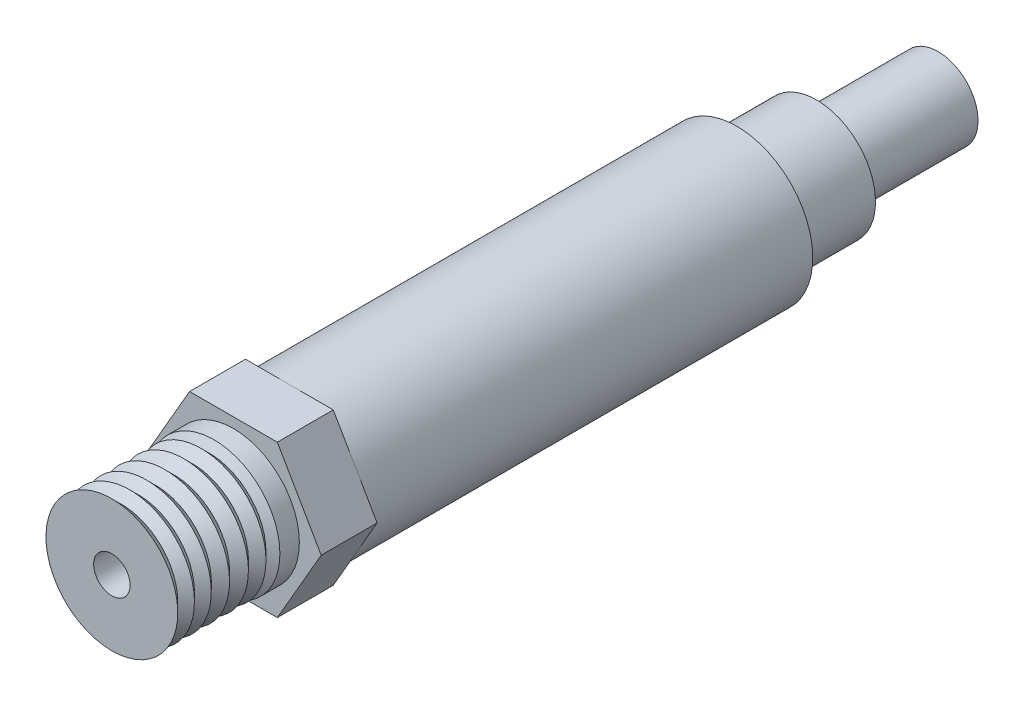
ISO-10303-21;
HEADER;
FILE_DESCRIPTION(('STEP AP214'),'2;1');
FILE_NAME('part.step','',(''),(''),'','','');
FILE_SCHEMA(('AUTOMOTIVE_DESIGN { 1 0 10303 214 1 1 1 1 }'));
ENDSEC;
DATA;
#1=APPLICATION_CONTEXT('core data for automotive mechanical design processes');
#2=APPLICATION_PROTOCOL_DEFINITION('international standard','automotive_design',2000,#1);
#3=PRODUCT_CONTEXT('',#1,'mechanical');
#4=PRODUCT('Part','Part','',(#3));
#5=PRODUCT_RELATED_PRODUCT_CATEGORY('part','',(#4));
#6=PRODUCT_DEFINITION_FORMATION('','',#4);
#7=PRODUCT_DEFINITION_CONTEXT('part definition',#1,'design');
#8=PRODUCT_DEFINITION('design','',#6,#7);
#9=PRODUCT_DEFINITION_SHAPE('','',#8);
#10=(LENGTH_UNIT() NAMED_UNIT(*) SI_UNIT(.MILLI.,.METRE.));
#11=(NAMED_UNIT(*) PLANE_ANGLE_UNIT() SI_UNIT($,.RADIAN.));
#12=(NAMED_UNIT(*) SI_UNIT($,.STERADIAN.) SOLID_ANGLE_UNIT());
#13=UNCERTAINTY_MEASURE_WITH_UNIT(LENGTH_MEASURE(1.E-05),#10,'distance_accuracy_value','');
#14=(GEOMETRIC_REPRESENTATION_CONTEXT(3) GLOBAL_UNCERTAINTY_ASSIGNED_CONTEXT((#13)) GLOBAL_UNIT_ASSIGNED_CONTEXT((#10,
#11,#12)) REPRESENTATION_CONTEXT('',''));
#15=CARTESIAN_POINT('',(0.,0.,0.));
#16=DIRECTION('',(0.,0.,1.));
#17=DIRECTION('',(1.,0.,0.));
#18=AXIS2_PLACEMENT_3D('',#15,#16,#17);
#19=CARTESIAN_POINT('',(0.,0.,-62.944375));
#20=DIRECTION('',(0.,0.,-1.));
#21=DIRECTION('',(-1.,0.,0.));
#22=AXIS2_PLACEMENT_3D('',#19,#20,#21);
#23=PLANE('',#22);
#24=CARTESIAN_POINT('',(0.,0.,-62.944375));
#25=DIRECTION('',(0.,0.,-1.));
#26=DIRECTION('',(-1.,0.,0.));
#27=AXIS2_PLACEMENT_3D('',#24,#25,#26);
#28=CIRCLE('',#27,6.1515625);
#29=CARTESIAN_POINT('',(-6.1515625,0.,-62.944375));
#30=VERTEX_POINT('',#29);
#31=EDGE_CURVE('E129',#30,#30,#28,.T.);
#32=ORIENTED_EDGE('',*,*,#31,.T.);
#33=EDGE_LOOP('',(#32));
#34=FACE_BOUND('',#33,.T.);
#35=CARTESIAN_POINT('',(0.,0.,-62.944375));
#36=DIRECTION('',(0.,0.,-1.));
#37=DIRECTION('',(-1.,0.,0.));
#38=AXIS2_PLACEMENT_3D('',#35,#36,#37);
#39=CIRCLE('',#38,4.1671875);
#40=CARTESIAN_POINT('',(-4.1671875,0.,-62.944375));
#41=VERTEX_POINT('',#40);
#42=EDGE_CURVE('E596',#41,#41,#39,.T.);
#43=ORIENTED_EDGE('',*,*,#42,.F.);
#44=EDGE_LOOP('',(#43));
#45=FACE_BOUND('',#44,.T.);
#46=ADVANCED_FACE('F34',(#34,#45),#23,.T.);
#47=CARTESIAN_POINT('',(0.,0.,-54.61));
#48=DIRECTION('',(0.,0.,-1.));
#49=DIRECTION('',(-1.,0.,0.));
#50=AXIS2_PLACEMENT_3D('',#47,#48,#49);
#51=PLANE('',#50);
#52=CARTESIAN_POINT('',(0.,0.,-54.61));
#53=DIRECTION('',(0.,0.,-1.));
#54=DIRECTION('',(-1.,0.,0.));
#55=AXIS2_PLACEMENT_3D('',#52,#53,#54);
#56=CIRCLE('',#55,7.9375);
#57=CARTESIAN_POINT('',(-7.9375,0.,-54.61));
#58=VERTEX_POINT('',#57);
#59=EDGE_CURVE('E128',#58,#58,#56,.T.);
#60=ORIENTED_EDGE('',*,*,#59,.T.);
#61=EDGE_LOOP('',(#60));
#62=FACE_BOUND('',#61,.T.);
#63=CARTESIAN_POINT('',(0.,0.,-54.61));
#64=DIRECTION('',(0.,0.,-1.));
#65=DIRECTION('',(-1.,0.,0.));
#66=AXIS2_PLACEMENT_3D('',#63,#64,#65);
#67=CIRCLE('',#66,6.1515625);
#68=CARTESIAN_POINT('',(-6.1515625,0.,-54.61));
#69=VERTEX_POINT('',#68);
#70=EDGE_CURVE('E595',#69,#69,#67,.T.);
#71=ORIENTED_EDGE('',*,*,#70,.F.);
#72=EDGE_LOOP('',(#71));
#73=FACE_BOUND('',#72,.T.);
#74=ADVANCED_FACE('F244',(#62,#73),#51,.T.);
#75=CARTESIAN_POINT('',(9.16543552338531,0.,-7.874));
#76=DIRECTION('',(0.,0.,-1.));
#77=DIRECTION('',(-1.,0.,0.));
#78=AXIS2_PLACEMENT_3D('',#75,#76,#77);
#79=PLANE('',#78);
#80=CARTESIAN_POINT('',(0.,0.,-7.874));
#81=DIRECTION('',(0.,0.,-1.));
#82=DIRECTION('',(-1.,0.,0.));
#83=AXIS2_PLACEMENT_3D('',#80,#81,#82);
#84=CIRCLE('',#83,7.9375);
#85=CARTESIAN_POINT('',(-6.87407664253898,3.96875,-7.874));
#86=VERTEX_POINT('',#85);
#87=CARTESIAN_POINT('',(0.,7.9375,-7.874));
#88=VERTEX_POINT('',#87);
#89=EDGE_CURVE('E45',#86,#88,#84,.T.);
#90=ORIENTED_EDGE('',*,*,#89,.F.);
#91=DIRECTION('',(0.5,0.866025403784439,0.));
#92=VECTOR('',#91,1.);
#93=CARTESIAN_POINT('',(-4.58271776169266,7.9375,-7.874));
#94=LINE('',#93,#92);
#95=CARTESIAN_POINT('',(-4.58271776169266,7.9375,-7.874));
#96=VERTEX_POINT('',#95);
#97=EDGE_CURVE('E113',#86,#96,#94,.T.);
#98=ORIENTED_EDGE('',*,*,#97,.T.);
#99=DIRECTION('',(1.,0.,0.));
#100=VECTOR('',#99,1.);
#101=CARTESIAN_POINT('',(4.58271776169265,7.9375,-7.874));
#102=LINE('',#101,#100);
#103=EDGE_CURVE('E126',#96,#88,#102,.T.);
#104=ORIENTED_EDGE('',*,*,#103,.T.);
#105=EDGE_LOOP('',(#90,#98,#104));
#106=FACE_BOUND('',#105,.T.);
#107=ADVANCED_FACE('F125',(#106),#79,.T.);
#108=CARTESIAN_POINT('',(6.87407664253898,3.96875,-7.874));
#109=VERTEX_POINT('',#108);
#110=EDGE_CURVE('E11',#88,#109,#84,.T.);
#111=ORIENTED_EDGE('',*,*,#110,.F.);
#112=CARTESIAN_POINT('',(4.58271776169265,7.9375,-7.874));
#113=VERTEX_POINT('',#112);
#114=EDGE_CURVE('E112',#88,#113,#102,.T.);
#115=ORIENTED_EDGE('',*,*,#114,.T.);
#116=DIRECTION('',(0.5,-0.866025403784438,0.));
#117=VECTOR('',#116,1.);
#118=CARTESIAN_POINT('',(9.16543552338531,0.,-7.874));
#119=LINE('',#118,#117);
#120=EDGE_CURVE('E156',#113,#109,#119,.T.);
#121=ORIENTED_EDGE('',*,*,#120,.T.);
#122=EDGE_LOOP('',(#111,#115,#121));
#123=FACE_BOUND('',#122,.T.);
#124=ADVANCED_FACE('F474',(#123),#79,.T.);
#125=CARTESIAN_POINT('',(6.87407664253898,-3.96875,-7.874));
#126=VERTEX_POINT('',#125);
#127=EDGE_CURVE('E43',#109,#126,#84,.T.);
#128=ORIENTED_EDGE('',*,*,#127,.F.);
#129=CARTESIAN_POINT('',(9.16543552338531,0.,-7.874));
#130=VERTEX_POINT('',#129);
#131=EDGE_CURVE('E155',#109,#130,#119,.T.);
#132=ORIENTED_EDGE('',*,*,#131,.T.);
#133=DIRECTION('',(-0.5,-0.866025403784439,0.));
#134=VECTOR('',#133,1.);
#135=CARTESIAN_POINT('',(4.58271776169265,-7.9375,-7.874));
#136=LINE('',#135,#134);
#137=EDGE_CURVE('E159',#130,#126,#136,.T.);
#138=ORIENTED_EDGE('',*,*,#137,.T.);
#139=EDGE_LOOP('',(#128,#132,#138));
#140=FACE_BOUND('',#139,.T.);
#141=ADVANCED_FACE('F481',(#140),#79,.T.);
#142=CARTESIAN_POINT('',(0.,-7.9375,-7.874));
#143=VERTEX_POINT('',#142);
#144=EDGE_CURVE('E134',#126,#143,#84,.T.);
#145=ORIENTED_EDGE('',*,*,#144,.F.);
#146=CARTESIAN_POINT('',(4.58271776169265,-7.9375,-7.874));
#147=VERTEX_POINT('',#146);
#148=EDGE_CURVE('E158',#126,#147,#136,.T.);
#149=ORIENTED_EDGE('',*,*,#148,.T.);
#150=DIRECTION('',(-1.,0.,0.));
#151=VECTOR('',#150,1.);
#152=CARTESIAN_POINT('',(4.58271776169265,-7.9375,-7.874));
#153=LINE('',#152,#151);
#154=EDGE_CURVE('E163',#147,#143,#153,.T.);
#155=ORIENTED_EDGE('',*,*,#154,.T.);
#156=EDGE_LOOP('',(#145,#149,#155));
#157=FACE_BOUND('',#156,.T.);
#158=ADVANCED_FACE('F488',(#157),#79,.T.);
#159=CARTESIAN_POINT('',(-6.87407664253898,-3.96875,-7.874));
#160=VERTEX_POINT('',#159);
#161=EDGE_CURVE('E133',#143,#160,#84,.T.);
#162=ORIENTED_EDGE('',*,*,#161,.F.);
#163=CARTESIAN_POINT('',(-4.58271776169265,-7.9375,-7.874));
#164=VERTEX_POINT('',#163);
#165=EDGE_CURVE('E162',#143,#164,#153,.T.);
#166=ORIENTED_EDGE('',*,*,#165,.T.);
#167=DIRECTION('',(-0.5,0.866025403784439,0.));
#168=VECTOR('',#167,1.);
#169=CARTESIAN_POINT('',(-9.16543552338531,0.,-7.874));
#170=LINE('',#169,#168);
#171=EDGE_CURVE('E123',#164,#160,#170,.T.);
#172=ORIENTED_EDGE('',*,*,#171,.T.);
#173=EDGE_LOOP('',(#162,#166,#172));
#174=FACE_BOUND('',#173,.T.);
#175=ADVANCED_FACE('F272',(#174),#79,.T.);
#176=CARTESIAN_POINT('',(0.,0.,10.668));
#177=DIRECTION('',(0.,0.,1.));
#178=DIRECTION('',(1.,0.,0.));
#179=AXIS2_PLACEMENT_3D('',#176,#177,#178);
#180=PLANE('',#179);
#181=CARTESIAN_POINT('',(0.,0.,10.668));
#182=DIRECTION('',(0.,0.,1.));
#183=DIRECTION('',(1.,0.,0.));
#184=AXIS2_PLACEMENT_3D('',#181,#182,#183);
#185=CIRCLE('',#184,1.905);
#186=CARTESIAN_POINT('',(1.905,0.,10.668));
#187=VERTEX_POINT('',#186);
#188=EDGE_CURVE('E187',#187,#187,#185,.T.);
#189=ORIENTED_EDGE('',*,*,#188,.F.);
#190=EDGE_LOOP('',(#189));
#191=FACE_BOUND('',#190,.T.);
#192=CARTESIAN_POINT('',(0.,0.,10.668));
#193=DIRECTION('',(0.,0.,1.));
#194=DIRECTION('',(0.,-1.,0.));
#195=AXIS2_PLACEMENT_3D('',#192,#193,#194);
#196=CIRCLE('',#195,6.88339999999998);
#197=CARTESIAN_POINT('',(0.,-6.88339999999998,10.668));
#198=VERTEX_POINT('',#197);
#199=EDGE_CURVE('E38',#198,#198,#196,.T.);
#200=ORIENTED_EDGE('',*,*,#199,.T.);
#201=EDGE_LOOP('',(#200));
#202=FACE_BOUND('',#201,.T.);
#203=ADVANCED_FACE('F36',(#191,#202),#180,.T.);
#204=CARTESIAN_POINT('',(0.,0.,10.668));
#205=DIRECTION('',(0.,0.,1.));
#206=DIRECTION('',(0.,-1.,0.));
#207=AXIS2_PLACEMENT_3D('',#204,#205,#206);
#208=CONICAL_SURFACE('',#207,6.88339999999998,0.785398163397433);
#209=CARTESIAN_POINT('',(0.,0.,9.67293695090437));
#210=DIRECTION('',(0.,0.,1.));
#211=DIRECTION('',(0.,-1.,0.));
#212=AXIS2_PLACEMENT_3D('',#209,#210,#211);
#213=CIRCLE('',#212,5.88833695090438);
#214=CARTESIAN_POINT('',(0.,-5.88833695090438,9.67293695090437));
#215=VERTEX_POINT('',#214);
#216=EDGE_CURVE('E136',#215,#215,#213,.T.);
#217=ORIENTED_EDGE('',*,*,#216,.T.);
#218=EDGE_LOOP('',(#217));
#219=FACE_BOUND('',#218,.T.);
#220=ORIENTED_EDGE('',*,*,#199,.F.);
#221=EDGE_LOOP('',(#220));
#222=FACE_BOUND('',#221,.T.);
#223=ADVANCED_FACE('F228',(#219,#222),#208,.T.);
#224=CARTESIAN_POINT('',(0.,0.,9.67293695090437));
#225=DIRECTION('',(0.,0.,-1.));
#226=DIRECTION('',(0.,1.,0.));
#227=AXIS2_PLACEMENT_3D('',#224,#225,#226);
#228=CONICAL_SURFACE('',#227,5.88833695090438,0.785398163397464);
#229=CARTESIAN_POINT('',(0.,0.,8.80237984496124));
#230=DIRECTION('',(0.,0.,1.));
#231=DIRECTION('',(0.,-1.,0.));
#232=AXIS2_PLACEMENT_3D('',#229,#230,#231);
#233=CIRCLE('',#232,6.75889405684754);
#234=CARTESIAN_POINT('',(0.,-6.75889405684754,8.80237984496124));
#235=VERTEX_POINT('',#234);
#236=EDGE_CURVE('E223',#235,#235,#233,.T.);
#237=ORIENTED_EDGE('',*,*,#236,.T.);
#238=EDGE_LOOP('',(#237));
#239=FACE_BOUND('',#238,.T.);
#240=ORIENTED_EDGE('',*,*,#216,.F.);
#241=EDGE_LOOP('',(#240));
#242=FACE_BOUND('',#241,.T.);
#243=ADVANCED_FACE('F231',(#239,#242),#228,.T.);
#244=CARTESIAN_POINT('',(0.,0.,8.80237984496124));
#245=DIRECTION('',(0.,0.,1.));
#246=DIRECTION('',(0.,-1.,0.));
#247=AXIS2_PLACEMENT_3D('',#244,#245,#246);
#248=CONICAL_SURFACE('',#247,6.75889405684754,0.785398163397432);
#249=CARTESIAN_POINT('',(0.,0.,7.92194496124028));
#250=DIRECTION('',(0.,0.,1.));
#251=DIRECTION('',(0.,-1.,0.));
#252=AXIS2_PLACEMENT_3D('',#249,#250,#251);
#253=CIRCLE('',#252,5.87845917312661);
#254=CARTESIAN_POINT('',(0.,-5.87845917312661,7.92194496124028));
#255=VERTEX_POINT('',#254);
#256=EDGE_CURVE('E220',#255,#255,#253,.T.);
#257=ORIENTED_EDGE('',*,*,#256,.T.);
#258=EDGE_LOOP('',(#257));
#259=FACE_BOUND('',#258,.T.);
#260=ORIENTED_EDGE('',*,*,#236,.F.);
#261=EDGE_LOOP('',(#260));
#262=FACE_BOUND('',#261,.T.);
#263=ADVANCED_FACE('F233',(#259,#262),#248,.T.);
#264=CARTESIAN_POINT('',(0.,0.,7.92194496124028));
#265=DIRECTION('',(0.,0.,-1.));
#266=DIRECTION('',(0.,1.,0.));
#267=AXIS2_PLACEMENT_3D('',#264,#265,#266);
#268=CONICAL_SURFACE('',#267,5.87845917312661,0.785398163397464);
#269=CARTESIAN_POINT('',(0.,0.,7.04151007751938));
#270=DIRECTION('',(0.,0.,1.));
#271=DIRECTION('',(0.,-1.,0.));
#272=AXIS2_PLACEMENT_3D('',#269,#270,#271);
#273=CIRCLE('',#272,6.75889405684754);
#274=CARTESIAN_POINT('',(0.,-6.75889405684754,7.04151007751938));
#275=VERTEX_POINT('',#274);
#276=EDGE_CURVE('E217',#275,#275,#273,.T.);
#277=ORIENTED_EDGE('',*,*,#276,.T.);
#278=EDGE_LOOP('',(#277));
#279=FACE_BOUND('',#278,.T.);
#280=ORIENTED_EDGE('',*,*,#256,.F.);
#281=EDGE_LOOP('',(#280));
#282=FACE_BOUND('',#281,.T.);
#283=ADVANCED_FACE('F240',(#279,#282),#268,.T.);
#284=CARTESIAN_POINT('',(0.,0.,7.04151007751938));
#285=DIRECTION('',(0.,0.,1.));
#286=DIRECTION('',(0.,-1.,0.));
#287=AXIS2_PLACEMENT_3D('',#284,#285,#286);
#288=CONICAL_SURFACE('',#287,6.75889405684754,0.785398163397433);
#289=CARTESIAN_POINT('',(0.,0.,6.08992894056845));
#290=DIRECTION('',(0.,0.,1.));
#291=DIRECTION('',(0.,-1.,0.));
#292=AXIS2_PLACEMENT_3D('',#289,#290,#291);
#293=CIRCLE('',#292,5.80731291989664);
#294=CARTESIAN_POINT('',(0.,-5.80731291989664,6.08992894056845));
#295=VERTEX_POINT('',#294);
#296=EDGE_CURVE('E214',#295,#295,#293,.T.);
#297=ORIENTED_EDGE('',*,*,#296,.T.);
#298=EDGE_LOOP('',(#297));
#299=FACE_BOUND('',#298,.T.);
#300=ORIENTED_EDGE('',*,*,#276,.F.);
#301=EDGE_LOOP('',(#300));
#302=FACE_BOUND('',#301,.T.);
#303=ADVANCED_FACE('F333',(#299,#302),#288,.T.);
#304=CARTESIAN_POINT('',(0.,0.,6.08992894056845));
#305=DIRECTION('',(0.,0.,-1.));
#306=DIRECTION('',(0.,1.,0.));
#307=AXIS2_PLACEMENT_3D('',#304,#305,#306);
#308=CONICAL_SURFACE('',#307,5.80731291989664,0.785398163397464);
#309=CARTESIAN_POINT('',(0.,0.,5.13834780361757));
#310=DIRECTION('',(0.,0.,1.));
#311=DIRECTION('',(0.,-1.,0.));
#312=AXIS2_PLACEMENT_3D('',#309,#310,#311);
#313=CIRCLE('',#312,6.75889405684754);
#314=CARTESIAN_POINT('',(0.,-6.75889405684754,5.13834780361757));
#315=VERTEX_POINT('',#314);
#316=EDGE_CURVE('E211',#315,#315,#313,.T.);
#317=ORIENTED_EDGE('',*,*,#316,.T.);
#318=EDGE_LOOP('',(#317));
#319=FACE_BOUND('',#318,.T.);
#320=ORIENTED_EDGE('',*,*,#296,.F.);
#321=EDGE_LOOP('',(#320));
#322=FACE_BOUND('',#321,.T.);
#323=ADVANCED_FACE('F329',(#319,#322),#308,.T.);
#324=CARTESIAN_POINT('',(0.,0.,5.13834780361757));
#325=DIRECTION('',(0.,0.,1.));
#326=DIRECTION('',(0.,-1.,0.));
#327=AXIS2_PLACEMENT_3D('',#324,#325,#326);
#328=CONICAL_SURFACE('',#327,6.75889405684754,0.785398163397432);
#329=CARTESIAN_POINT('',(0.,0.,4.15119354005165));
#330=DIRECTION('',(0.,0.,1.));
#331=DIRECTION('',(0.,-1.,0.));
#332=AXIS2_PLACEMENT_3D('',#329,#330,#331);
#333=CIRCLE('',#332,5.77173979328165);
#334=CARTESIAN_POINT('',(0.,-5.77173979328165,4.15119354005165));
#335=VERTEX_POINT('',#334);
#336=EDGE_CURVE('E208',#335,#335,#333,.T.);
#337=ORIENTED_EDGE('',*,*,#336,.T.);
#338=EDGE_LOOP('',(#337));
#339=FACE_BOUND('',#338,.T.);
#340=ORIENTED_EDGE('',*,*,#316,.F.);
#341=EDGE_LOOP('',(#340));
#342=FACE_BOUND('',#341,.T.);
#343=ADVANCED_FACE('F325',(#339,#342),#328,.T.);
#344=CARTESIAN_POINT('',(0.,0.,4.15119354005165));
#345=DIRECTION('',(0.,0.,-1.));
#346=DIRECTION('',(0.,1.,0.));
#347=AXIS2_PLACEMENT_3D('',#344,#345,#346);
#348=CONICAL_SURFACE('',#347,5.77173979328165,0.785398163397465);
#349=CARTESIAN_POINT('',(0.,0.,3.16403927648579));
#350=DIRECTION('',(0.,0.,1.));
#351=DIRECTION('',(0.,-1.,0.));
#352=AXIS2_PLACEMENT_3D('',#349,#350,#351);
#353=CIRCLE('',#352,6.75889405684754);
#354=CARTESIAN_POINT('',(0.,-6.75889405684754,3.16403927648579));
#355=VERTEX_POINT('',#354);
#356=EDGE_CURVE('E205',#355,#355,#353,.T.);
#357=ORIENTED_EDGE('',*,*,#356,.T.);
#358=EDGE_LOOP('',(#357));
#359=FACE_BOUND('',#358,.T.);
#360=ORIENTED_EDGE('',*,*,#336,.F.);
#361=EDGE_LOOP('',(#360));
#362=FACE_BOUND('',#361,.T.);
#363=ADVANCED_FACE('F321',(#359,#362),#348,.T.);
#364=CARTESIAN_POINT('',(0.,0.,3.16403927648579));
#365=DIRECTION('',(0.,0.,1.));
#366=DIRECTION('',(0.,-1.,0.));
#367=AXIS2_PLACEMENT_3D('',#364,#365,#366);
#368=CONICAL_SURFACE('',#367,6.75889405684754,0.785398163397447);
#369=CARTESIAN_POINT('',(0.,0.,2.24803126614987));
#370=DIRECTION('',(0.,0.,1.));
#371=DIRECTION('',(0.,-1.,0.));
#372=AXIS2_PLACEMENT_3D('',#369,#370,#371);
#373=CIRCLE('',#372,5.84288604651162);
#374=CARTESIAN_POINT('',(0.,-5.84288604651162,2.24803126614987));
#375=VERTEX_POINT('',#374);
#376=EDGE_CURVE('E202',#375,#375,#373,.T.);
#377=ORIENTED_EDGE('',*,*,#376,.T.);
#378=EDGE_LOOP('',(#377));
#379=FACE_BOUND('',#378,.T.);
#380=ORIENTED_EDGE('',*,*,#356,.F.);
#381=EDGE_LOOP('',(#380));
#382=FACE_BOUND('',#381,.T.);
#383=ADVANCED_FACE('F317',(#379,#382),#368,.T.);
#384=CARTESIAN_POINT('',(0.,0.,2.24803126614987));
#385=DIRECTION('',(0.,0.,-1.));
#386=DIRECTION('',(0.,1.,0.));
#387=AXIS2_PLACEMENT_3D('',#384,#385,#386);
#388=CONICAL_SURFACE('',#387,5.84288604651162,0.78539816339745);
#389=CARTESIAN_POINT('',(0.,0.,1.33202325581396));
#390=DIRECTION('',(0.,0.,1.));
#391=DIRECTION('',(0.,-1.,0.));
#392=AXIS2_PLACEMENT_3D('',#389,#390,#391);
#393=CIRCLE('',#392,6.75889405684754);
#394=CARTESIAN_POINT('',(0.,-6.75889405684754,1.33202325581396));
#395=VERTEX_POINT('',#394);
#396=EDGE_CURVE('E199',#395,#395,#393,.T.);
#397=ORIENTED_EDGE('',*,*,#396,.T.);
#398=EDGE_LOOP('',(#397));
#399=FACE_BOUND('',#398,.T.);
#400=ORIENTED_EDGE('',*,*,#376,.F.);
#401=EDGE_LOOP('',(#400));
#402=FACE_BOUND('',#401,.T.);
#403=ADVANCED_FACE('F313',(#399,#402),#388,.T.);
#404=CARTESIAN_POINT('',(0.,0.,1.33202325581396));
#405=DIRECTION('',(0.,0.,1.));
#406=DIRECTION('',(0.,-1.,0.));
#407=AXIS2_PLACEMENT_3D('',#404,#405,#406);
#408=CONICAL_SURFACE('',#407,6.75889405684754,0.785398163397447);
#409=CARTESIAN_POINT('',(0.,0.,0.514702761949875));
#410=DIRECTION('',(0.,0.,1.));
#411=DIRECTION('',(0.,-1.,0.));
#412=AXIS2_PLACEMENT_3D('',#409,#410,#411);
#413=CIRCLE('',#412,5.94157356298346);
#414=CARTESIAN_POINT('',(0.,-5.94157356298346,0.514702761949876));
#415=VERTEX_POINT('',#414);
#416=EDGE_CURVE('E196',#415,#415,#413,.T.);
#417=ORIENTED_EDGE('',*,*,#416,.T.);
#418=EDGE_LOOP('',(#417));
#419=FACE_BOUND('',#418,.T.);
#420=ORIENTED_EDGE('',*,*,#396,.F.);
#421=EDGE_LOOP('',(#420));
#422=FACE_BOUND('',#421,.T.);
#423=ADVANCED_FACE('F309',(#419,#422),#408,.T.);
#424=CARTESIAN_POINT('',(0.,0.,0.514702761949875));
#425=DIRECTION('',(0.,0.,-1.));
#426=DIRECTION('',(0.,1.,0.));
#427=AXIS2_PLACEMENT_3D('',#424,#425,#426);
#428=CONICAL_SURFACE('',#427,5.94157356298346,1.07064863018592);
#429=CARTESIAN_POINT('',(0.,0.,0.));
#430=DIRECTION('',(0.,0.,1.));
#431=DIRECTION('',(1.,0.,0.));
#432=AXIS2_PLACEMENT_3D('',#429,#430,#431);
#433=CIRCLE('',#432,6.88339999999998);
#434=CARTESIAN_POINT('',(6.88339999999998,0.,0.));
#435=VERTEX_POINT('',#434);
#436=EDGE_CURVE('E193',#435,#435,#433,.T.);
#437=ORIENTED_EDGE('',*,*,#436,.T.);
#438=EDGE_LOOP('',(#437));
#439=FACE_BOUND('',#438,.T.);
#440=ORIENTED_EDGE('',*,*,#416,.F.);
#441=EDGE_LOOP('',(#440));
#442=FACE_BOUND('',#441,.T.);
#443=ADVANCED_FACE('F305',(#439,#442),#428,.T.);
#444=CARTESIAN_POINT('',(0.,0.,-2.032));
#445=DIRECTION('',(0.,0.,1.));
#446=DIRECTION('',(1.,0.,0.));
#447=AXIS2_PLACEMENT_3D('',#444,#445,#446);
#448=CYLINDRICAL_SURFACE('',#447,6.88339999999998);
#449=CARTESIAN_POINT('',(0.,0.,-2.032));
#450=DIRECTION('',(0.,0.,-1.));
#451=DIRECTION('',(-1.,0.,0.));
#452=AXIS2_PLACEMENT_3D('',#449,#450,#451);
#453=CIRCLE('',#452,6.88339999999998);
#454=CARTESIAN_POINT('',(-6.88339999999998,0.,-2.032));
#455=VERTEX_POINT('',#454);
#456=EDGE_CURVE('E184',#455,#455,#453,.F.);
#457=ORIENTED_EDGE('',*,*,#456,.T.);
#458=EDGE_LOOP('',(#457));
#459=FACE_BOUND('',#458,.T.);
#460=ORIENTED_EDGE('',*,*,#436,.F.);
#461=EDGE_LOOP('',(#460));
#462=FACE_BOUND('',#461,.T.);
#463=ADVANCED_FACE('F301',(#459,#462),#448,.T.);
#464=CARTESIAN_POINT('',(0.,0.,4.318));
#465=DIRECTION('',(0.,0.,1.));
#466=DIRECTION('',(1.,0.,0.));
#467=AXIS2_PLACEMENT_3D('',#464,#465,#466);
#468=CYLINDRICAL_SURFACE('',#467,1.905);
#469=CARTESIAN_POINT('',(0.,0.,4.318));
#470=DIRECTION('',(0.,0.,1.));
#471=DIRECTION('',(1.,0.,0.));
#472=AXIS2_PLACEMENT_3D('',#469,#470,#471);
#473=CIRCLE('',#472,1.905);
#474=CARTESIAN_POINT('',(1.905,0.,4.318));
#475=VERTEX_POINT('',#474);
#476=EDGE_CURVE('E190',#475,#475,#473,.T.);
#477=ORIENTED_EDGE('',*,*,#476,.F.);
#478=EDGE_LOOP('',(#477));
#479=FACE_BOUND('',#478,.T.);
#480=ORIENTED_EDGE('',*,*,#188,.T.);
#481=EDGE_LOOP('',(#480));
#482=FACE_BOUND('',#481,.T.);
#483=ADVANCED_FACE('F297',(#479,#482),#468,.F.);
#484=CARTESIAN_POINT('',(0.,0.,4.318));
#485=DIRECTION('',(0.,0.,1.));
#486=DIRECTION('',(1.,0.,0.));
#487=AXIS2_PLACEMENT_3D('',#484,#485,#486);
#488=PLANE('',#487);
#489=ORIENTED_EDGE('',*,*,#476,.T.);
#490=EDGE_LOOP('',(#489));
#491=FACE_BOUND('',#490,.T.);
#492=ADVANCED_FACE('F293',(#491),#488,.T.);
#493=CARTESIAN_POINT('',(9.16543552338531,0.,-7.874));
#494=DIRECTION('',(-0.866025403784439,-0.5,0.));
#495=DIRECTION('',(0.5,-0.866025403784438,0.));
#496=AXIS2_PLACEMENT_3D('',#493,#494,#495);
#497=PLANE('',#496);
#498=DIRECTION('',(0.5,-0.866025403784438,0.));
#499=VECTOR('',#498,1.);
#500=CARTESIAN_POINT('',(9.16543552338531,0.,-2.032));
#501=LINE('',#500,#499);
#502=CARTESIAN_POINT('',(4.58271776169265,7.9375,-2.032));
#503=VERTEX_POINT('',#502);
#504=CARTESIAN_POINT('',(9.16543552338531,0.,-2.032));
#505=VERTEX_POINT('',#504);
#506=EDGE_CURVE('E142',#503,#505,#501,.T.);
#507=ORIENTED_EDGE('',*,*,#506,.T.);
#508=DIRECTION('',(0.,0.,1.));
#509=VECTOR('',#508,1.);
#510=CARTESIAN_POINT('',(9.16543552338531,0.,-7.874));
#511=LINE('',#510,#509);
#512=EDGE_CURVE('E181',#130,#505,#511,.T.);
#513=ORIENTED_EDGE('',*,*,#512,.F.);
#514=ORIENTED_EDGE('',*,*,#131,.F.);
#515=ORIENTED_EDGE('',*,*,#120,.F.);
#516=DIRECTION('',(0.,0.,1.));
#517=VECTOR('',#516,1.);
#518=CARTESIAN_POINT('',(4.58271776169265,7.9375,-7.874));
#519=LINE('',#518,#517);
#520=EDGE_CURVE('E169',#113,#503,#519,.T.);
#521=ORIENTED_EDGE('',*,*,#520,.T.);
#522=EDGE_LOOP('',(#507,#513,#514,#515,#521));
#523=FACE_BOUND('',#522,.T.);
#524=ADVANCED_FACE('F289',(#523),#497,.F.);
#525=CARTESIAN_POINT('',(4.58271776169265,-7.9375,-7.874));
#526=DIRECTION('',(-0.866025403784439,0.5,0.));
#527=DIRECTION('',(-0.5,-0.866025403784439,0.));
#528=AXIS2_PLACEMENT_3D('',#525,#526,#527);
#529=PLANE('',#528);
#530=DIRECTION('',(-0.5,-0.866025403784439,0.));
#531=VECTOR('',#530,1.);
#532=CARTESIAN_POINT('',(4.58271776169265,-7.9375,-2.032));
#533=LINE('',#532,#531);
#534=CARTESIAN_POINT('',(4.58271776169265,-7.9375,-2.032));
#535=VERTEX_POINT('',#534);
#536=EDGE_CURVE('E145',#505,#535,#533,.T.);
#537=ORIENTED_EDGE('',*,*,#536,.T.);
#538=DIRECTION('',(0.,0.,1.));
#539=VECTOR('',#538,1.);
#540=CARTESIAN_POINT('',(4.58271776169265,-7.9375,-7.874));
#541=LINE('',#540,#539);
#542=EDGE_CURVE('E178',#147,#535,#541,.T.);
#543=ORIENTED_EDGE('',*,*,#542,.F.);
#544=ORIENTED_EDGE('',*,*,#148,.F.);
#545=ORIENTED_EDGE('',*,*,#137,.F.);
#546=ORIENTED_EDGE('',*,*,#512,.T.);
#547=EDGE_LOOP('',(#537,#543,#544,#545,#546));
#548=FACE_BOUND('',#547,.T.);
#549=ADVANCED_FACE('F285',(#548),#529,.F.);
#550=CARTESIAN_POINT('',(4.58271776169265,-7.9375,-7.874));
#551=DIRECTION('',(0.,1.,0.));
#552=DIRECTION('',(0.,0.,1.));
#553=AXIS2_PLACEMENT_3D('',#550,#551,#552);
#554=PLANE('',#553);
#555=DIRECTION('',(-1.,0.,0.));
#556=VECTOR('',#555,1.);
#557=CARTESIAN_POINT('',(4.58271776169265,-7.9375,-2.032));
#558=LINE('',#557,#556);
#559=CARTESIAN_POINT('',(-4.58271776169265,-7.9375,-2.032));
#560=VERTEX_POINT('',#559);
#561=EDGE_CURVE('E147',#535,#560,#558,.T.);
#562=ORIENTED_EDGE('',*,*,#561,.T.);
#563=DIRECTION('',(0.,0.,1.));
#564=VECTOR('',#563,1.);
#565=CARTESIAN_POINT('',(-4.58271776169265,-7.9375,-7.874));
#566=LINE('',#565,#564);
#567=EDGE_CURVE('E175',#164,#560,#566,.T.);
#568=ORIENTED_EDGE('',*,*,#567,.F.);
#569=ORIENTED_EDGE('',*,*,#165,.F.);
#570=ORIENTED_EDGE('',*,*,#154,.F.);
#571=ORIENTED_EDGE('',*,*,#542,.T.);
#572=EDGE_LOOP('',(#562,#568,#569,#570,#571));
#573=FACE_BOUND('',#572,.T.);
#574=ADVANCED_FACE('F281',(#573),#554,.F.);
#575=CARTESIAN_POINT('',(-9.16543552338531,0.,-7.874));
#576=DIRECTION('',(0.866025403784439,0.5,0.));
#577=DIRECTION('',(-0.5,0.866025403784439,0.));
#578=AXIS2_PLACEMENT_3D('',#575,#576,#577);
#579=PLANE('',#578);
#580=DIRECTION('',(-0.5,0.866025403784439,0.));
#581=VECTOR('',#580,1.);
#582=CARTESIAN_POINT('',(-9.16543552338531,0.,-2.032));
#583=LINE('',#582,#581);
#584=CARTESIAN_POINT('',(-9.16543552338531,0.,-2.032));
#585=VERTEX_POINT('',#584);
#586=EDGE_CURVE('E149',#560,#585,#583,.T.);
#587=ORIENTED_EDGE('',*,*,#586,.T.);
#588=DIRECTION('',(0.,0.,1.));
#589=VECTOR('',#588,1.);
#590=CARTESIAN_POINT('',(-9.16543552338531,0.,-7.874));
#591=LINE('',#590,#589);
#592=CARTESIAN_POINT('',(-9.16543552338531,0.,-7.874));
#593=VERTEX_POINT('',#592);
#594=EDGE_CURVE('E173',#593,#585,#591,.T.);
#595=ORIENTED_EDGE('',*,*,#594,.F.);
#596=EDGE_CURVE('E108',#160,#593,#170,.T.);
#597=ORIENTED_EDGE('',*,*,#596,.F.);
#598=ORIENTED_EDGE('',*,*,#171,.F.);
#599=ORIENTED_EDGE('',*,*,#567,.T.);
#600=EDGE_LOOP('',(#587,#595,#597,#598,#599));
#601=FACE_BOUND('',#600,.T.);
#602=ADVANCED_FACE('F278',(#601),#579,.F.);
#603=CARTESIAN_POINT('',(-4.58271776169266,7.9375,-7.874));
#604=DIRECTION('',(0.866025403784439,-0.5,0.));
#605=DIRECTION('',(0.5,0.866025403784439,0.));
#606=AXIS2_PLACEMENT_3D('',#603,#604,#605);
#607=PLANE('',#606);
#608=DIRECTION('',(0.5,0.866025403784439,0.));
#609=VECTOR('',#608,1.);
#610=CARTESIAN_POINT('',(-4.58271776169266,7.9375,-2.032));
#611=LINE('',#610,#609);
#612=CARTESIAN_POINT('',(-4.58271776169266,7.9375,-2.032));
#613=VERTEX_POINT('',#612);
#614=EDGE_CURVE('E151',#585,#613,#611,.T.);
#615=ORIENTED_EDGE('',*,*,#614,.T.);
#616=DIRECTION('',(0.,0.,1.));
#617=VECTOR('',#616,1.);
#618=CARTESIAN_POINT('',(-4.58271776169266,7.9375,-7.874));
#619=LINE('',#618,#617);
#620=EDGE_CURVE('E119',#96,#613,#619,.T.);
#621=ORIENTED_EDGE('',*,*,#620,.F.);
#622=ORIENTED_EDGE('',*,*,#97,.F.);
#623=EDGE_CURVE('E105',#593,#86,#94,.T.);
#624=ORIENTED_EDGE('',*,*,#623,.F.);
#625=ORIENTED_EDGE('',*,*,#594,.T.);
#626=EDGE_LOOP('',(#615,#621,#622,#624,#625));
#627=FACE_BOUND('',#626,.T.);
#628=ADVANCED_FACE('F117',(#627),#607,.F.);
#629=CARTESIAN_POINT('',(4.58271776169265,7.9375,-7.874));
#630=DIRECTION('',(0.,-1.,0.));
#631=DIRECTION('',(0.,0.,-1.));
#632=AXIS2_PLACEMENT_3D('',#629,#630,#631);
#633=PLANE('',#632);
#634=DIRECTION('',(1.,0.,0.));
#635=VECTOR('',#634,1.);
#636=CARTESIAN_POINT('',(4.58271776169265,7.9375,-2.032));
#637=LINE('',#636,#635);
#638=EDGE_CURVE('E153',#613,#503,#637,.T.);
#639=ORIENTED_EDGE('',*,*,#638,.T.);
#640=ORIENTED_EDGE('',*,*,#520,.F.);
#641=ORIENTED_EDGE('',*,*,#114,.F.);
#642=ORIENTED_EDGE('',*,*,#103,.F.);
#643=ORIENTED_EDGE('',*,*,#620,.T.);
#644=EDGE_LOOP('',(#639,#640,#641,#642,#643));
#645=FACE_BOUND('',#644,.T.);
#646=ADVANCED_FACE('F271',(#645),#633,.F.);
#647=EDGE_CURVE('E58',#160,#86,#84,.T.);
#648=ORIENTED_EDGE('',*,*,#647,.F.);
#649=ORIENTED_EDGE('',*,*,#596,.T.);
#650=ORIENTED_EDGE('',*,*,#623,.T.);
#651=EDGE_LOOP('',(#648,#649,#650));
#652=FACE_BOUND('',#651,.T.);
#653=ADVANCED_FACE('F107',(#652),#79,.T.);
#654=CARTESIAN_POINT('',(9.16543552338531,0.,-2.032));
#655=DIRECTION('',(0.,0.,-1.));
#656=DIRECTION('',(-1.,0.,0.));
#657=AXIS2_PLACEMENT_3D('',#654,#655,#656);
#658=PLANE('',#657);
#659=ORIENTED_EDGE('',*,*,#456,.F.);
#660=EDGE_LOOP('',(#659));
#661=FACE_BOUND('',#660,.T.);
#662=ORIENTED_EDGE('',*,*,#506,.F.);
#663=ORIENTED_EDGE('',*,*,#638,.F.);
#664=ORIENTED_EDGE('',*,*,#614,.F.);
#665=ORIENTED_EDGE('',*,*,#586,.F.);
#666=ORIENTED_EDGE('',*,*,#561,.F.);
#667=ORIENTED_EDGE('',*,*,#536,.F.);
#668=EDGE_LOOP('',(#662,#663,#664,#665,#666,#667));
#669=FACE_BOUND('',#668,.T.);
#670=ADVANCED_FACE('F264',(#661,#669),#658,.F.);
#671=CARTESIAN_POINT('',(0.,0.,-54.61));
#672=DIRECTION('',(0.,0.,1.));
#673=DIRECTION('',(1.,0.,0.));
#674=AXIS2_PLACEMENT_3D('',#671,#672,#673);
#675=CYLINDRICAL_SURFACE('',#674,7.9375);
#676=ORIENTED_EDGE('',*,*,#59,.F.);
#677=EDGE_LOOP('',(#676));
#678=FACE_BOUND('',#677,.T.);
#679=ORIENTED_EDGE('',*,*,#89,.T.);
#680=ORIENTED_EDGE('',*,*,#110,.T.);
#681=ORIENTED_EDGE('',*,*,#127,.T.);
#682=ORIENTED_EDGE('',*,*,#144,.T.);
#683=ORIENTED_EDGE('',*,*,#161,.T.);
#684=ORIENTED_EDGE('',*,*,#647,.T.);
#685=EDGE_LOOP('',(#679,#680,#681,#682,#683,#684));
#686=FACE_BOUND('',#685,.T.);
#687=ADVANCED_FACE('F131',(#678,#686),#675,.T.);
#688=CARTESIAN_POINT('',(0.,0.,-62.944375));
#689=DIRECTION('',(0.,0.,1.));
#690=DIRECTION('',(1.,0.,0.));
#691=AXIS2_PLACEMENT_3D('',#688,#689,#690);
#692=CYLINDRICAL_SURFACE('',#691,6.1515625);
#693=ORIENTED_EDGE('',*,*,#31,.F.);
#694=EDGE_LOOP('',(#693));
#695=FACE_BOUND('',#694,.T.);
#696=ORIENTED_EDGE('',*,*,#70,.T.);
#697=EDGE_LOOP('',(#696));
#698=FACE_BOUND('',#697,.T.);
#699=ADVANCED_FACE('F258',(#695,#698),#692,.T.);
#700=CARTESIAN_POINT('',(0.,0.,-75.644375));
#701=DIRECTION('',(0.,0.,1.));
#702=DIRECTION('',(1.,0.,0.));
#703=AXIS2_PLACEMENT_3D('',#700,#701,#702);
#704=CYLINDRICAL_SURFACE('',#703,4.1671875);
#705=CARTESIAN_POINT('',(0.,0.,-75.644375));
#706=DIRECTION('',(0.,0.,-1.));
#707=DIRECTION('',(-1.,0.,0.));
#708=AXIS2_PLACEMENT_3D('',#705,#706,#707);
#709=CIRCLE('',#708,4.1671875);
#710=CARTESIAN_POINT('',(-4.1671875,0.,-75.644375));
#711=VERTEX_POINT('',#710);
#712=EDGE_CURVE('E594',#711,#711,#709,.T.);
#713=ORIENTED_EDGE('',*,*,#712,.F.);
#714=EDGE_LOOP('',(#713));
#715=FACE_BOUND('',#714,.T.);
#716=ORIENTED_EDGE('',*,*,#42,.T.);
#717=EDGE_LOOP('',(#716));
#718=FACE_BOUND('',#717,.T.);
#719=ADVANCED_FACE('F256',(#715,#718),#704,.T.);
#720=CARTESIAN_POINT('',(0.,0.,-75.644375));
#721=DIRECTION('',(0.,0.,-1.));
#722=DIRECTION('',(-1.,0.,0.));
#723=AXIS2_PLACEMENT_3D('',#720,#721,#722);
#724=PLANE('',#723);
#725=ORIENTED_EDGE('',*,*,#712,.T.);
#726=EDGE_LOOP('',(#725));
#727=FACE_BOUND('',#726,.T.);
#728=ADVANCED_FACE('F444',(#727),#724,.T.);
#729=CLOSED_SHELL('',(#46,#74,#107,#124,#141,#158,#175,#203,#223,#243,#263,#283,#303,#323,#343,
#363,#383,#403,#423,#443,#463,#483,#492,#524,#549,#574,#602,#628,#646,#653,#670,#687,#699,#719,#728));
#730=MANIFOLD_SOLID_BREP('B2',#729);
#731=ADVANCED_BREP_SHAPE_REPRESENTATION('',(#18,#730),#14);
#732=SHAPE_DEFINITION_REPRESENTATION(#9,#731);
ENDSEC;
END-ISO-10303-21;
